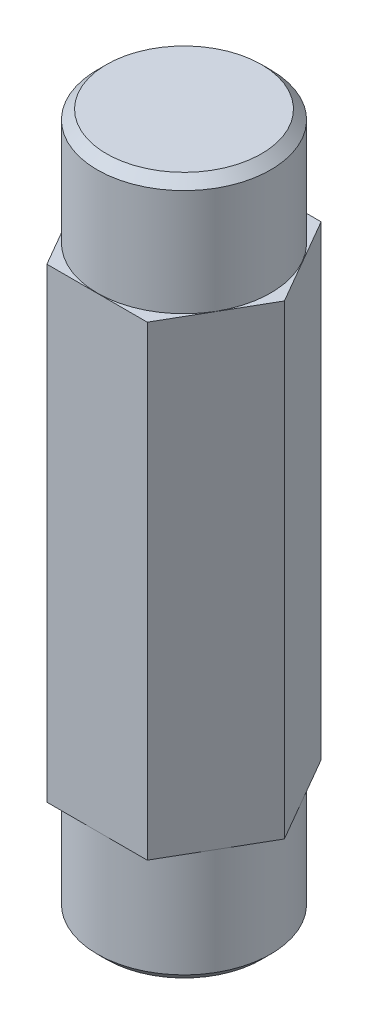
ISO-10303-21;
HEADER;
FILE_DESCRIPTION(('STEP AP214'),'2;1');
FILE_NAME('part.step','',(''),(''),'','','');
FILE_SCHEMA(('AUTOMOTIVE_DESIGN { 1 0 10303 214 1 1 1 1 }'));
ENDSEC;
DATA;
#1=APPLICATION_CONTEXT('core data for automotive mechanical design processes');
#2=APPLICATION_PROTOCOL_DEFINITION('international standard','automotive_design',2000,#1);
#3=PRODUCT_CONTEXT('',#1,'mechanical');
#4=PRODUCT('Part','Part','',(#3));
#5=PRODUCT_RELATED_PRODUCT_CATEGORY('part','',(#4));
#6=PRODUCT_DEFINITION_FORMATION('','',#4);
#7=PRODUCT_DEFINITION_CONTEXT('part definition',#1,'design');
#8=PRODUCT_DEFINITION('design','',#6,#7);
#9=PRODUCT_DEFINITION_SHAPE('','',#8);
#10=(LENGTH_UNIT() NAMED_UNIT(*) SI_UNIT(.MILLI.,.METRE.));
#11=(NAMED_UNIT(*) PLANE_ANGLE_UNIT() SI_UNIT($,.RADIAN.));
#12=(NAMED_UNIT(*) SI_UNIT($,.STERADIAN.) SOLID_ANGLE_UNIT());
#13=UNCERTAINTY_MEASURE_WITH_UNIT(LENGTH_MEASURE(1.E-05),#10,'distance_accuracy_value','');
#14=(GEOMETRIC_REPRESENTATION_CONTEXT(3) GLOBAL_UNCERTAINTY_ASSIGNED_CONTEXT((#13)) GLOBAL_UNIT_ASSIGNED_CONTEXT((#10,
#11,#12)) REPRESENTATION_CONTEXT('',''));
#15=CARTESIAN_POINT('',(0.,0.,0.));
#16=DIRECTION('',(0.,0.,1.));
#17=DIRECTION('',(1.,0.,0.));
#18=AXIS2_PLACEMENT_3D('',#15,#16,#17);
#19=CARTESIAN_POINT('',(-39.2241243202131,-31.877,-16.6661167863655));
#20=DIRECTION('',(0.,-1.,0.));
#21=DIRECTION('',(0.,0.,-1.));
#22=AXIS2_PLACEMENT_3D('',#19,#20,#21);
#23=PLANE('',#22);
#24=CARTESIAN_POINT('',(-39.2241243202131,-31.8769999999517,-16.6661167863655));
#25=DIRECTION('',(0.,1.,0.));
#26=DIRECTION('',(0.,0.,1.));
#27=AXIS2_PLACEMENT_3D('',#24,#25,#26);
#28=CIRCLE('',#27,4.24180000002854);
#29=CARTESIAN_POINT('',(-39.2241243202131,-31.8769999999517,-12.4243167863369));
#30=VERTEX_POINT('',#29);
#31=EDGE_CURVE('E20',#30,#30,#28,.T.);
#32=ORIENTED_EDGE('',*,*,#31,.F.);
#33=EDGE_LOOP('',(#32));
#34=FACE_BOUND('',#33,.T.);
#35=ADVANCED_FACE('F17',(#34),#23,.T.);
#36=CARTESIAN_POINT('',(-39.2241243202131,6.35,-16.6661167863655));
#37=DIRECTION('',(0.,1.,0.));
#38=DIRECTION('',(0.,0.,1.));
#39=AXIS2_PLACEMENT_3D('',#36,#37,#38);
#40=PLANE('',#39);
#41=CARTESIAN_POINT('',(-39.2241243202131,6.35000000005448,-16.6661167863655));
#42=DIRECTION('',(0.,-1.,0.));
#43=DIRECTION('',(0.,0.,-1.));
#44=AXIS2_PLACEMENT_3D('',#41,#42,#43);
#45=CIRCLE('',#44,4.2417999999483);
#46=CARTESIAN_POINT('',(-39.2241243202131,6.35000000005448,-20.9079167863138));
#47=VERTEX_POINT('',#46);
#48=EDGE_CURVE('E101',#47,#47,#45,.T.);
#49=ORIENTED_EDGE('',*,*,#48,.F.);
#50=EDGE_LOOP('',(#49));
#51=FACE_BOUND('',#50,.T.);
#52=ADVANCED_FACE('F117',(#51),#40,.T.);
#53=CARTESIAN_POINT('',(-39.2241243202131,-31.3689999999838,-16.6661167863655));
#54=DIRECTION('',(0.,1.,0.));
#55=DIRECTION('',(0.,0.,1.));
#56=AXIS2_PLACEMENT_3D('',#53,#54,#55);
#57=CONICAL_SURFACE('',#56,4.74979999999652,0.785398163397448);
#58=CARTESIAN_POINT('',(-39.2241243202131,-31.369,-16.6661167863655));
#59=DIRECTION('',(0.,1.,0.));
#60=DIRECTION('',(0.,0.,1.));
#61=AXIS2_PLACEMENT_3D('',#58,#59,#60);
#62=CIRCLE('',#61,4.7498);
#63=CARTESIAN_POINT('',(-39.2241243202131,-31.369,-11.9163167863655));
#64=VERTEX_POINT('',#63);
#65=EDGE_CURVE('E96',#64,#64,#62,.T.);
#66=ORIENTED_EDGE('',*,*,#65,.F.);
#67=EDGE_LOOP('',(#66));
#68=FACE_BOUND('',#67,.T.);
#69=ORIENTED_EDGE('',*,*,#31,.T.);
#70=EDGE_LOOP('',(#69));
#71=FACE_BOUND('',#70,.T.);
#72=ADVANCED_FACE('F114',(#68,#71),#57,.T.);
#73=CARTESIAN_POINT('',(-39.2241243202131,5.84199999997281,-16.6661167863655));
#74=DIRECTION('',(0.,-1.,0.));
#75=DIRECTION('',(0.,0.,-1.));
#76=AXIS2_PLACEMENT_3D('',#73,#74,#75);
#77=CONICAL_SURFACE('',#76,4.74980000002996,0.785398163397448);
#78=ORIENTED_EDGE('',*,*,#48,.T.);
#79=EDGE_LOOP('',(#78));
#80=FACE_BOUND('',#79,.T.);
#81=CARTESIAN_POINT('',(-39.2241243202131,5.842,-16.6661167863655));
#82=DIRECTION('',(0.,-1.,0.));
#83=DIRECTION('',(0.,0.,-1.));
#84=AXIS2_PLACEMENT_3D('',#81,#82,#83);
#85=CIRCLE('',#84,4.7498);
#86=CARTESIAN_POINT('',(-39.2241243202131,5.842,-21.4159167863655));
#87=VERTEX_POINT('',#86);
#88=EDGE_CURVE('E80',#87,#87,#85,.T.);
#89=ORIENTED_EDGE('',*,*,#88,.F.);
#90=EDGE_LOOP('',(#89));
#91=FACE_BOUND('',#90,.T.);
#92=ADVANCED_FACE('F161',(#80,#91),#77,.T.);
#93=CARTESIAN_POINT('',(-39.2241243202131,-31.877,-16.6661167863655));
#94=DIRECTION('',(0.,1.,0.));
#95=DIRECTION('',(0.,0.,1.));
#96=AXIS2_PLACEMENT_3D('',#93,#94,#95);
#97=CYLINDRICAL_SURFACE('',#96,4.7498);
#98=CARTESIAN_POINT('',(-39.2241243202131,-25.527,-16.6661167863655));
#99=DIRECTION('',(0.,1.,0.));
#100=DIRECTION('',(0.,0.,1.));
#101=AXIS2_PLACEMENT_3D('',#98,#99,#100);
#102=CIRCLE('',#101,4.7498);
#103=CARTESIAN_POINT('',(-39.2241243202131,-25.527,-11.9163167863655));
#104=VERTEX_POINT('',#103);
#105=EDGE_CURVE('E105',#104,#104,#102,.T.);
#106=ORIENTED_EDGE('',*,*,#105,.F.);
#107=EDGE_LOOP('',(#106));
#108=FACE_BOUND('',#107,.T.);
#109=ORIENTED_EDGE('',*,*,#65,.T.);
#110=EDGE_LOOP('',(#109));
#111=FACE_BOUND('',#110,.T.);
#112=ADVANCED_FACE('F158',(#108,#111),#97,.T.);
#113=CARTESIAN_POINT('',(-41.9737549772287,0.,-11.9036167863655));
#114=DIRECTION('',(-0.866025403784439,0.,0.5));
#115=DIRECTION('',(0.5,0.,0.866025403784439));
#116=AXIS2_PLACEMENT_3D('',#113,#114,#115);
#117=PLANE('',#116);
#118=DIRECTION('',(-0.5,0.,-0.866025403784439));
#119=VECTOR('',#118,1.);
#120=CARTESIAN_POINT('',(-41.9737549772287,0.,-11.9036167863655));
#121=LINE('',#120,#119);
#122=CARTESIAN_POINT('',(-41.9737549772287,0.,-11.9036167863655));
#123=VERTEX_POINT('',#122);
#124=CARTESIAN_POINT('',(-44.7233856342443,0.,-16.6661167863655));
#125=VERTEX_POINT('',#124);
#126=EDGE_CURVE('E274',#123,#125,#121,.T.);
#127=ORIENTED_EDGE('',*,*,#126,.T.);
#128=DIRECTION('',(0.,1.,0.));
#129=VECTOR('',#128,1.);
#130=CARTESIAN_POINT('',(-44.7233856342443,0.,-16.6661167863655));
#131=LINE('',#130,#129);
#132=CARTESIAN_POINT('',(-44.7233856342443,-25.527,-16.6661167863655));
#133=VERTEX_POINT('',#132);
#134=EDGE_CURVE('E67',#133,#125,#131,.T.);
#135=ORIENTED_EDGE('',*,*,#134,.F.);
#136=DIRECTION('',(-0.5,0.,-0.866025403784439));
#137=VECTOR('',#136,1.);
#138=CARTESIAN_POINT('',(-41.9737549772287,-25.527,-11.9036167863655));
#139=LINE('',#138,#137);
#140=CARTESIAN_POINT('',(-41.9737549772287,-25.527,-11.9036167863655));
#141=VERTEX_POINT('',#140);
#142=EDGE_CURVE('E83',#141,#133,#139,.T.);
#143=ORIENTED_EDGE('',*,*,#142,.F.);
#144=DIRECTION('',(0.,1.,0.));
#145=VECTOR('',#144,1.);
#146=CARTESIAN_POINT('',(-41.9737549772287,0.,-11.9036167863655));
#147=LINE('',#146,#145);
#148=EDGE_CURVE('E72',#123,#141,#147,.F.);
#149=ORIENTED_EDGE('',*,*,#148,.F.);
#150=EDGE_LOOP('',(#127,#135,#143,#149));
#151=FACE_BOUND('',#150,.T.);
#152=ADVANCED_FACE('F84',(#151),#117,.T.);
#153=CARTESIAN_POINT('',(-44.7233856342443,0.,-16.6661167863655));
#154=DIRECTION('',(-0.866025403784438,0.,-0.500000000000001));
#155=DIRECTION('',(-0.500000000000001,0.,0.866025403784438));
#156=AXIS2_PLACEMENT_3D('',#153,#154,#155);
#157=PLANE('',#156);
#158=DIRECTION('',(0.500000000000001,0.,-0.866025403784438));
#159=VECTOR('',#158,1.);
#160=CARTESIAN_POINT('',(-44.7233856342443,0.,-16.6661167863655));
#161=LINE('',#160,#159);
#162=CARTESIAN_POINT('',(-41.9737549772287,0.,-21.4286167863655));
#163=VERTEX_POINT('',#162);
#164=EDGE_CURVE('E268',#125,#163,#161,.T.);
#165=ORIENTED_EDGE('',*,*,#164,.T.);
#166=DIRECTION('',(0.,1.,0.));
#167=VECTOR('',#166,1.);
#168=CARTESIAN_POINT('',(-41.9737549772287,0.,-21.4286167863655));
#169=LINE('',#168,#167);
#170=CARTESIAN_POINT('',(-41.9737549772287,-25.527,-21.4286167863655));
#171=VERTEX_POINT('',#170);
#172=EDGE_CURVE('E270',#171,#163,#169,.T.);
#173=ORIENTED_EDGE('',*,*,#172,.F.);
#174=DIRECTION('',(0.500000000000001,0.,-0.866025403784438));
#175=VECTOR('',#174,1.);
#176=CARTESIAN_POINT('',(-44.7233856342443,-25.527,-16.6661167863655));
#177=LINE('',#176,#175);
#178=EDGE_CURVE('E86',#133,#171,#177,.T.);
#179=ORIENTED_EDGE('',*,*,#178,.F.);
#180=ORIENTED_EDGE('',*,*,#134,.T.);
#181=EDGE_LOOP('',(#165,#173,#179,#180));
#182=FACE_BOUND('',#181,.T.);
#183=ADVANCED_FACE('F151',(#182),#157,.T.);
#184=CARTESIAN_POINT('',(-39.2241243202131,6.35,-16.6661167863655));
#185=DIRECTION('',(0.,-1.,0.));
#186=DIRECTION('',(0.,0.,-1.));
#187=AXIS2_PLACEMENT_3D('',#184,#185,#186);
#188=CYLINDRICAL_SURFACE('',#187,4.7498);
#189=ORIENTED_EDGE('',*,*,#88,.T.);
#190=EDGE_LOOP('',(#189));
#191=FACE_BOUND('',#190,.T.);
#192=CARTESIAN_POINT('',(-39.2241243202131,0.,-16.6661167863655));
#193=DIRECTION('',(0.,-1.,0.));
#194=DIRECTION('',(0.,0.,-1.));
#195=AXIS2_PLACEMENT_3D('',#192,#193,#194);
#196=CIRCLE('',#195,4.7498);
#197=CARTESIAN_POINT('',(-39.2241243202131,0.,-21.4159167863655));
#198=VERTEX_POINT('',#197);
#199=EDGE_CURVE('E102',#198,#198,#196,.F.);
#200=ORIENTED_EDGE('',*,*,#199,.T.);
#201=EDGE_LOOP('',(#200));
#202=FACE_BOUND('',#201,.T.);
#203=ADVANCED_FACE('F148',(#191,#202),#188,.T.);
#204=CARTESIAN_POINT('',(-36.4744936631975,0.,-11.9036167863655));
#205=DIRECTION('',(0.,0.,1.));
#206=DIRECTION('',(1.,0.,0.));
#207=AXIS2_PLACEMENT_3D('',#204,#205,#206);
#208=PLANE('',#207);
#209=DIRECTION('',(1.,0.,0.));
#210=VECTOR('',#209,1.);
#211=CARTESIAN_POINT('',(-41.9737549772287,0.,-11.9036167863655));
#212=LINE('',#211,#210);
#213=CARTESIAN_POINT('',(-36.4744936631975,0.,-11.9036167863655));
#214=VERTEX_POINT('',#213);
#215=EDGE_CURVE('E78',#214,#123,#212,.F.);
#216=ORIENTED_EDGE('',*,*,#215,.T.);
#217=ORIENTED_EDGE('',*,*,#148,.T.);
#218=DIRECTION('',(1.,0.,0.));
#219=VECTOR('',#218,1.);
#220=CARTESIAN_POINT('',(-41.9737549772287,-25.527,-11.9036167863655));
#221=LINE('',#220,#219);
#222=CARTESIAN_POINT('',(-36.4744936631975,-25.527,-11.9036167863655));
#223=VERTEX_POINT('',#222);
#224=EDGE_CURVE('E76',#223,#141,#221,.F.);
#225=ORIENTED_EDGE('',*,*,#224,.F.);
#226=DIRECTION('',(0.,1.,0.));
#227=VECTOR('',#226,1.);
#228=CARTESIAN_POINT('',(-36.4744936631975,0.,-11.9036167863655));
#229=LINE('',#228,#227);
#230=EDGE_CURVE('E288',#214,#223,#229,.F.);
#231=ORIENTED_EDGE('',*,*,#230,.F.);
#232=EDGE_LOOP('',(#216,#217,#225,#231));
#233=FACE_BOUND('',#232,.T.);
#234=ADVANCED_FACE('F73',(#233),#208,.T.);
#235=CARTESIAN_POINT('',(-41.9737549772287,-25.527,-11.9036167863655));
#236=DIRECTION('',(0.,-1.,0.));
#237=DIRECTION('',(0.,0.,-1.));
#238=AXIS2_PLACEMENT_3D('',#235,#236,#237);
#239=PLANE('',#238);
#240=ORIENTED_EDGE('',*,*,#105,.T.);
#241=EDGE_LOOP('',(#240));
#242=FACE_BOUND('',#241,.T.);
#243=DIRECTION('',(-0.5,0.,-0.866025403784439));
#244=VECTOR('',#243,1.);
#245=CARTESIAN_POINT('',(-36.4744936631975,-25.527,-21.4286167863655));
#246=LINE('',#245,#244);
#247=CARTESIAN_POINT('',(-33.7248630061819,-25.527,-16.6661167863655));
#248=VERTEX_POINT('',#247);
#249=CARTESIAN_POINT('',(-36.4744936631975,-25.527,-21.4286167863655));
#250=VERTEX_POINT('',#249);
#251=EDGE_CURVE('E285',#248,#250,#246,.T.);
#252=ORIENTED_EDGE('',*,*,#251,.F.);
#253=DIRECTION('',(0.500000000000001,0.,-0.866025403784438));
#254=VECTOR('',#253,1.);
#255=CARTESIAN_POINT('',(-33.7248630061819,-25.527,-16.6661167863655));
#256=LINE('',#255,#254);
#257=EDGE_CURVE('E90',#223,#248,#256,.T.);
#258=ORIENTED_EDGE('',*,*,#257,.F.);
#259=ORIENTED_EDGE('',*,*,#224,.T.);
#260=ORIENTED_EDGE('',*,*,#142,.T.);
#261=ORIENTED_EDGE('',*,*,#178,.T.);
#262=DIRECTION('',(-1.,0.,0.));
#263=VECTOR('',#262,1.);
#264=CARTESIAN_POINT('',(-41.9737549772287,-25.527,-21.4286167863655));
#265=LINE('',#264,#263);
#266=EDGE_CURVE('E107',#250,#171,#265,.T.);
#267=ORIENTED_EDGE('',*,*,#266,.F.);
#268=EDGE_LOOP('',(#252,#258,#259,#260,#261,#267));
#269=FACE_BOUND('',#268,.T.);
#270=ADVANCED_FACE('F88',(#242,#269),#239,.T.);
#271=CARTESIAN_POINT('',(-41.9737549772287,0.,-21.4286167863655));
#272=DIRECTION('',(0.,0.,-1.));
#273=DIRECTION('',(-1.,0.,0.));
#274=AXIS2_PLACEMENT_3D('',#271,#272,#273);
#275=PLANE('',#274);
#276=DIRECTION('',(1.,0.,0.));
#277=VECTOR('',#276,1.);
#278=CARTESIAN_POINT('',(-41.9737549772287,0.,-21.4286167863655));
#279=LINE('',#278,#277);
#280=CARTESIAN_POINT('',(-36.4744936631975,0.,-21.4286167863655));
#281=VERTEX_POINT('',#280);
#282=EDGE_CURVE('E273',#163,#281,#279,.T.);
#283=ORIENTED_EDGE('',*,*,#282,.T.);
#284=DIRECTION('',(0.,1.,0.));
#285=VECTOR('',#284,1.);
#286=CARTESIAN_POINT('',(-36.4744936631975,0.,-21.4286167863655));
#287=LINE('',#286,#285);
#288=EDGE_CURVE('E286',#250,#281,#287,.T.);
#289=ORIENTED_EDGE('',*,*,#288,.F.);
#290=ORIENTED_EDGE('',*,*,#266,.T.);
#291=ORIENTED_EDGE('',*,*,#172,.T.);
#292=EDGE_LOOP('',(#283,#289,#290,#291));
#293=FACE_BOUND('',#292,.T.);
#294=ADVANCED_FACE('F138',(#293),#275,.T.);
#295=CARTESIAN_POINT('',(-41.9737549772287,0.,-11.9036167863655));
#296=DIRECTION('',(0.,-1.,0.));
#297=DIRECTION('',(0.,0.,-1.));
#298=AXIS2_PLACEMENT_3D('',#295,#296,#297);
#299=PLANE('',#298);
#300=ORIENTED_EDGE('',*,*,#199,.F.);
#301=EDGE_LOOP('',(#300));
#302=FACE_BOUND('',#301,.T.);
#303=DIRECTION('',(0.500000000000001,0.,-0.866025403784438));
#304=VECTOR('',#303,1.);
#305=CARTESIAN_POINT('',(-33.7248630061819,0.,-16.6661167863655));
#306=LINE('',#305,#304);
#307=CARTESIAN_POINT('',(-33.7248630061819,0.,-16.6661167863655));
#308=VERTEX_POINT('',#307);
#309=EDGE_CURVE('E35',#308,#214,#306,.F.);
#310=ORIENTED_EDGE('',*,*,#309,.F.);
#311=DIRECTION('',(-0.5,0.,-0.866025403784439));
#312=VECTOR('',#311,1.);
#313=CARTESIAN_POINT('',(-36.4744936631975,0.,-21.4286167863655));
#314=LINE('',#313,#312);
#315=EDGE_CURVE('E26',#281,#308,#314,.F.);
#316=ORIENTED_EDGE('',*,*,#315,.F.);
#317=ORIENTED_EDGE('',*,*,#282,.F.);
#318=ORIENTED_EDGE('',*,*,#164,.F.);
#319=ORIENTED_EDGE('',*,*,#126,.F.);
#320=ORIENTED_EDGE('',*,*,#215,.F.);
#321=EDGE_LOOP('',(#310,#316,#317,#318,#319,#320));
#322=FACE_BOUND('',#321,.T.);
#323=ADVANCED_FACE('F131',(#302,#322),#299,.F.);
#324=CARTESIAN_POINT('',(-33.7248630061819,0.,-16.6661167863655));
#325=DIRECTION('',(0.866025403784438,0.,0.500000000000001));
#326=DIRECTION('',(0.500000000000001,0.,-0.866025403784438));
#327=AXIS2_PLACEMENT_3D('',#324,#325,#326);
#328=PLANE('',#327);
#329=ORIENTED_EDGE('',*,*,#309,.T.);
#330=ORIENTED_EDGE('',*,*,#230,.T.);
#331=ORIENTED_EDGE('',*,*,#257,.T.);
#332=DIRECTION('',(0.,1.,0.));
#333=VECTOR('',#332,1.);
#334=CARTESIAN_POINT('',(-33.7248630061819,0.,-16.6661167863655));
#335=LINE('',#334,#333);
#336=EDGE_CURVE('E11',#308,#248,#335,.F.);
#337=ORIENTED_EDGE('',*,*,#336,.F.);
#338=EDGE_LOOP('',(#329,#330,#331,#337));
#339=FACE_BOUND('',#338,.T.);
#340=ADVANCED_FACE('F125',(#339),#328,.T.);
#341=CARTESIAN_POINT('',(-36.4744936631975,0.,-21.4286167863655));
#342=DIRECTION('',(0.866025403784439,0.,-0.5));
#343=DIRECTION('',(-0.5,0.,-0.866025403784439));
#344=AXIS2_PLACEMENT_3D('',#341,#342,#343);
#345=PLANE('',#344);
#346=ORIENTED_EDGE('',*,*,#315,.T.);
#347=ORIENTED_EDGE('',*,*,#336,.T.);
#348=ORIENTED_EDGE('',*,*,#251,.T.);
#349=ORIENTED_EDGE('',*,*,#288,.T.);
#350=EDGE_LOOP('',(#346,#347,#348,#349));
#351=FACE_BOUND('',#350,.T.);
#352=ADVANCED_FACE('F123',(#351),#345,.T.);
#353=CLOSED_SHELL('',(#35,#52,#72,#92,#112,#152,#183,#203,#234,#270,#294,#323,#340,#352));
#354=MANIFOLD_SOLID_BREP('B1',#353);
#355=ADVANCED_BREP_SHAPE_REPRESENTATION('',(#18,#354),#14);
#356=SHAPE_DEFINITION_REPRESENTATION(#9,#355);
ENDSEC;
END-ISO-10303-21;
